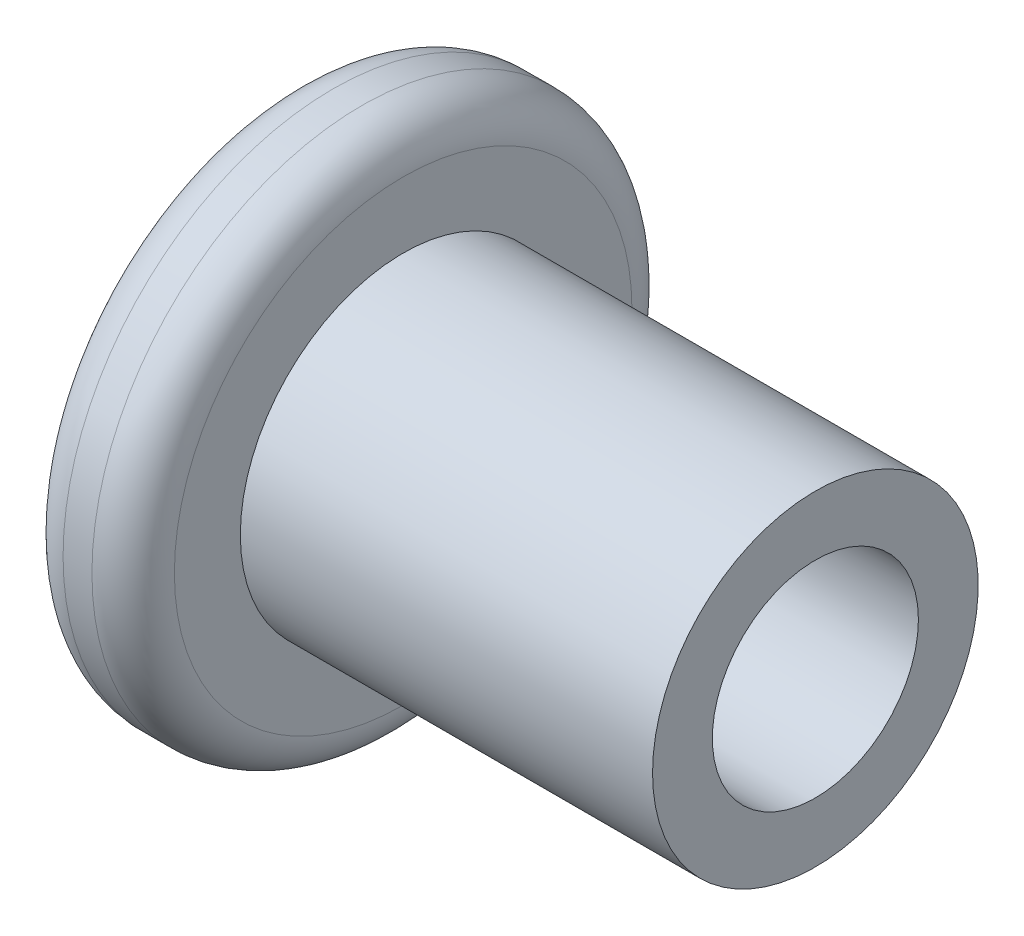
ISO-10303-21;
HEADER;
FILE_DESCRIPTION(('STEP AP214'),'2;1');
FILE_NAME('part.step','',(''),(''),'','','');
FILE_SCHEMA(('AUTOMOTIVE_DESIGN { 1 0 10303 214 1 1 1 1 }'));
ENDSEC;
DATA;
#1=APPLICATION_CONTEXT('core data for automotive mechanical design processes');
#2=APPLICATION_PROTOCOL_DEFINITION('international standard','automotive_design',2000,#1);
#3=PRODUCT_CONTEXT('',#1,'mechanical');
#4=PRODUCT('Part','Part','',(#3));
#5=PRODUCT_RELATED_PRODUCT_CATEGORY('part','',(#4));
#6=PRODUCT_DEFINITION_FORMATION('','',#4);
#7=PRODUCT_DEFINITION_CONTEXT('part definition',#1,'design');
#8=PRODUCT_DEFINITION('design','',#6,#7);
#9=PRODUCT_DEFINITION_SHAPE('','',#8);
#10=(LENGTH_UNIT() NAMED_UNIT(*) SI_UNIT(.MILLI.,.METRE.));
#11=(NAMED_UNIT(*) PLANE_ANGLE_UNIT() SI_UNIT($,.RADIAN.));
#12=(NAMED_UNIT(*) SI_UNIT($,.STERADIAN.) SOLID_ANGLE_UNIT());
#13=UNCERTAINTY_MEASURE_WITH_UNIT(LENGTH_MEASURE(1.E-05),#10,'distance_accuracy_value','');
#14=(GEOMETRIC_REPRESENTATION_CONTEXT(3) GLOBAL_UNCERTAINTY_ASSIGNED_CONTEXT((#13)) GLOBAL_UNIT_ASSIGNED_CONTEXT((#10,
#11,#12)) REPRESENTATION_CONTEXT('',''));
#15=CARTESIAN_POINT('',(0.,0.,0.));
#16=DIRECTION('',(0.,0.,1.));
#17=DIRECTION('',(1.,0.,0.));
#18=AXIS2_PLACEMENT_3D('',#15,#16,#17);
#19=CARTESIAN_POINT('',(0.,0.,0.));
#20=DIRECTION('',(1.,0.,0.));
#21=DIRECTION('',(0.,0.,-1.));
#22=AXIS2_PLACEMENT_3D('',#19,#20,#21);
#23=PLANE('',#22);
#24=DIRECTION('',(0.,0.,-1.));
#25=VECTOR('',#24,1.);
#26=CARTESIAN_POINT('',(0.,2.,1.15470053837925));
#27=LINE('',#26,#25);
#28=CARTESIAN_POINT('',(0.,2.,1.15470053837925));
#29=VERTEX_POINT('',#28);
#30=CARTESIAN_POINT('',(0.,2.,-1.15470053837925));
#31=VERTEX_POINT('',#30);
#32=EDGE_CURVE('E130',#29,#31,#27,.T.);
#33=ORIENTED_EDGE('',*,*,#32,.F.);
#34=DIRECTION('',(0.,0.866025403784438,-0.5));
#35=VECTOR('',#34,1.);
#36=CARTESIAN_POINT('',(0.,0.,2.3094010767585));
#37=LINE('',#36,#35);
#38=CARTESIAN_POINT('',(0.,0.,2.3094010767585));
#39=VERTEX_POINT('',#38);
#40=EDGE_CURVE('E54',#39,#29,#37,.T.);
#41=ORIENTED_EDGE('',*,*,#40,.F.);
#42=DIRECTION('',(0.,0.866025403784439,0.5));
#43=VECTOR('',#42,1.);
#44=CARTESIAN_POINT('',(0.,-2.,1.15470053837925));
#45=LINE('',#44,#43);
#46=CARTESIAN_POINT('',(0.,-2.,1.15470053837925));
#47=VERTEX_POINT('',#46);
#48=EDGE_CURVE('E140',#47,#39,#45,.T.);
#49=ORIENTED_EDGE('',*,*,#48,.F.);
#50=DIRECTION('',(0.,0.,1.));
#51=VECTOR('',#50,1.);
#52=CARTESIAN_POINT('',(0.,-2.,-1.15470053837925));
#53=LINE('',#52,#51);
#54=CARTESIAN_POINT('',(0.,-2.,-1.15470053837925));
#55=VERTEX_POINT('',#54);
#56=EDGE_CURVE('E138',#55,#47,#53,.T.);
#57=ORIENTED_EDGE('',*,*,#56,.F.);
#58=DIRECTION('',(0.,-0.866025403784439,0.5));
#59=VECTOR('',#58,1.);
#60=CARTESIAN_POINT('',(0.,0.,-2.3094010767585));
#61=LINE('',#60,#59);
#62=CARTESIAN_POINT('',(0.,0.,-2.3094010767585));
#63=VERTEX_POINT('',#62);
#64=EDGE_CURVE('E104',#63,#55,#61,.T.);
#65=ORIENTED_EDGE('',*,*,#64,.F.);
#66=DIRECTION('',(0.,-0.866025403784439,-0.5));
#67=VECTOR('',#66,1.);
#68=CARTESIAN_POINT('',(0.,2.,-1.15470053837925));
#69=LINE('',#68,#67);
#70=EDGE_CURVE('E134',#31,#63,#69,.T.);
#71=ORIENTED_EDGE('',*,*,#70,.F.);
#72=EDGE_LOOP('',(#33,#41,#49,#57,#65,#71));
#73=FACE_BOUND('',#72,.T.);
#74=CARTESIAN_POINT('',(0.,0.,0.));
#75=DIRECTION('',(1.,0.,0.));
#76=DIRECTION('',(0.,0.,-1.));
#77=AXIS2_PLACEMENT_3D('',#74,#75,#76);
#78=CIRCLE('',#77,5.55);
#79=CARTESIAN_POINT('',(0.,0.,-5.55));
#80=VERTEX_POINT('',#79);
#81=EDGE_CURVE('E11',#80,#80,#78,.F.);
#82=ORIENTED_EDGE('',*,*,#81,.T.);
#83=EDGE_LOOP('',(#82));
#84=FACE_BOUND('',#83,.T.);
#85=ADVANCED_FACE('F39',(#73,#84),#23,.F.);
#86=CARTESIAN_POINT('',(0.,0.,0.));
#87=DIRECTION('',(-1.,0.,0.));
#88=DIRECTION('',(0.,0.,1.));
#89=AXIS2_PLACEMENT_3D('',#86,#87,#88);
#90=CYLINDRICAL_SURFACE('',#89,6.55);
#91=CARTESIAN_POINT('',(1.7,0.,0.));
#92=DIRECTION('',(-1.,0.,0.));
#93=DIRECTION('',(0.,0.,1.));
#94=AXIS2_PLACEMENT_3D('',#91,#92,#93);
#95=CIRCLE('',#94,6.55);
#96=CARTESIAN_POINT('',(1.7,0.,6.55));
#97=VERTEX_POINT('',#96);
#98=EDGE_CURVE('E158',#97,#97,#95,.T.);
#99=ORIENTED_EDGE('',*,*,#98,.T.);
#100=EDGE_LOOP('',(#99));
#101=FACE_BOUND('',#100,.T.);
#102=CARTESIAN_POINT('',(1.,0.,0.));
#103=DIRECTION('',(1.,0.,0.));
#104=DIRECTION('',(0.,0.,-1.));
#105=AXIS2_PLACEMENT_3D('',#102,#103,#104);
#106=CIRCLE('',#105,6.55);
#107=CARTESIAN_POINT('',(1.,0.,-6.55));
#108=VERTEX_POINT('',#107);
#109=EDGE_CURVE('E155',#108,#108,#106,.T.);
#110=ORIENTED_EDGE('',*,*,#109,.T.);
#111=EDGE_LOOP('',(#110));
#112=FACE_BOUND('',#111,.T.);
#113=ADVANCED_FACE('F172',(#101,#112),#90,.T.);
#114=CARTESIAN_POINT('',(2.7,6.55,0.));
#115=DIRECTION('',(-1.,0.,0.));
#116=DIRECTION('',(0.,0.,1.));
#117=AXIS2_PLACEMENT_3D('',#114,#115,#116);
#118=PLANE('',#117);
#119=CARTESIAN_POINT('',(2.7,0.,0.));
#120=DIRECTION('',(-1.,0.,0.));
#121=DIRECTION('',(0.,0.,1.));
#122=AXIS2_PLACEMENT_3D('',#119,#120,#121);
#123=CIRCLE('',#122,5.55);
#124=CARTESIAN_POINT('',(2.7,0.,5.55));
#125=VERTEX_POINT('',#124);
#126=EDGE_CURVE('E47',#125,#125,#123,.F.);
#127=ORIENTED_EDGE('',*,*,#126,.T.);
#128=EDGE_LOOP('',(#127));
#129=FACE_BOUND('',#128,.T.);
#130=CARTESIAN_POINT('',(2.7,0.,0.));
#131=DIRECTION('',(-1.,0.,0.));
#132=DIRECTION('',(0.,0.,1.));
#133=AXIS2_PLACEMENT_3D('',#130,#131,#132);
#134=CIRCLE('',#133,3.95);
#135=CARTESIAN_POINT('',(2.7,0.,3.95));
#136=VERTEX_POINT('',#135);
#137=EDGE_CURVE('E152',#136,#136,#134,.T.);
#138=ORIENTED_EDGE('',*,*,#137,.T.);
#139=EDGE_LOOP('',(#138));
#140=FACE_BOUND('',#139,.T.);
#141=ADVANCED_FACE('F163',(#129,#140),#118,.F.);
#142=CARTESIAN_POINT('',(0.,0.,0.));
#143=DIRECTION('',(-1.,0.,0.));
#144=DIRECTION('',(0.,0.,1.));
#145=AXIS2_PLACEMENT_3D('',#142,#143,#144);
#146=CYLINDRICAL_SURFACE('',#145,3.95);
#147=ORIENTED_EDGE('',*,*,#137,.F.);
#148=EDGE_LOOP('',(#147));
#149=FACE_BOUND('',#148,.T.);
#150=CARTESIAN_POINT('',(12.7,0.,0.));
#151=DIRECTION('',(-1.,0.,0.));
#152=DIRECTION('',(0.,0.,1.));
#153=AXIS2_PLACEMENT_3D('',#150,#151,#152);
#154=CIRCLE('',#153,3.95);
#155=CARTESIAN_POINT('',(12.7,0.,3.95));
#156=VERTEX_POINT('',#155);
#157=EDGE_CURVE('E144',#156,#156,#154,.T.);
#158=ORIENTED_EDGE('',*,*,#157,.T.);
#159=EDGE_LOOP('',(#158));
#160=FACE_BOUND('',#159,.T.);
#161=ADVANCED_FACE('F192',(#149,#160),#146,.T.);
#162=CARTESIAN_POINT('',(12.7,3.95,0.));
#163=DIRECTION('',(-1.,0.,0.));
#164=DIRECTION('',(0.,0.,1.));
#165=AXIS2_PLACEMENT_3D('',#162,#163,#164);
#166=PLANE('',#165);
#167=CARTESIAN_POINT('',(12.7,0.,0.));
#168=DIRECTION('',(1.,0.,0.));
#169=DIRECTION('',(0.,0.,-1.));
#170=AXIS2_PLACEMENT_3D('',#167,#168,#169);
#171=CIRCLE('',#170,2.5);
#172=CARTESIAN_POINT('',(12.7,0.,-2.5));
#173=VERTEX_POINT('',#172);
#174=EDGE_CURVE('E232',#173,#173,#171,.T.);
#175=ORIENTED_EDGE('',*,*,#174,.F.);
#176=EDGE_LOOP('',(#175));
#177=FACE_BOUND('',#176,.T.);
#178=ORIENTED_EDGE('',*,*,#157,.F.);
#179=EDGE_LOOP('',(#178));
#180=FACE_BOUND('',#179,.T.);
#181=ADVANCED_FACE('F169',(#177,#180),#166,.F.);
#182=CARTESIAN_POINT('',(1.7,0.,0.));
#183=DIRECTION('',(-1.,0.,0.));
#184=DIRECTION('',(0.,0.,1.));
#185=AXIS2_PLACEMENT_3D('',#182,#183,#184);
#186=TOROIDAL_SURFACE('',#185,5.55,1.);
#187=ORIENTED_EDGE('',*,*,#126,.F.);
#188=EDGE_LOOP('',(#187));
#189=FACE_BOUND('',#188,.T.);
#190=ORIENTED_EDGE('',*,*,#98,.F.);
#191=EDGE_LOOP('',(#190));
#192=FACE_BOUND('',#191,.T.);
#193=ADVANCED_FACE('F166',(#189,#192),#186,.T.);
#194=CARTESIAN_POINT('',(1.,0.,0.));
#195=DIRECTION('',(1.,0.,0.));
#196=DIRECTION('',(0.,0.,-1.));
#197=AXIS2_PLACEMENT_3D('',#194,#195,#196);
#198=TOROIDAL_SURFACE('',#197,5.55,1.);
#199=ORIENTED_EDGE('',*,*,#109,.F.);
#200=EDGE_LOOP('',(#199));
#201=FACE_BOUND('',#200,.T.);
#202=ORIENTED_EDGE('',*,*,#81,.F.);
#203=EDGE_LOOP('',(#202));
#204=FACE_BOUND('',#203,.T.);
#205=ADVANCED_FACE('F41',(#201,#204),#198,.T.);
#206=CARTESIAN_POINT('',(1.,0.,2.3094010767585));
#207=DIRECTION('',(0.,0.5,0.866025403784439));
#208=DIRECTION('',(0.,-0.866025403784439,0.5));
#209=AXIS2_PLACEMENT_3D('',#206,#207,#208);
#210=PLANE('',#209);
#211=ORIENTED_EDGE('',*,*,#40,.T.);
#212=DIRECTION('',(-1.,0.,0.));
#213=VECTOR('',#212,1.);
#214=CARTESIAN_POINT('',(1.,2.,1.15470053837925));
#215=LINE('',#214,#213);
#216=CARTESIAN_POINT('',(1.,2.,1.15470053837925));
#217=VERTEX_POINT('',#216);
#218=EDGE_CURVE('E85',#217,#29,#215,.T.);
#219=ORIENTED_EDGE('',*,*,#218,.F.);
#220=DIRECTION('',(0.,0.866025403784438,-0.5));
#221=VECTOR('',#220,1.);
#222=CARTESIAN_POINT('',(1.,0.,2.3094010767585));
#223=LINE('',#222,#221);
#224=CARTESIAN_POINT('',(1.,0.,2.3094010767585));
#225=VERTEX_POINT('',#224);
#226=EDGE_CURVE('E142',#225,#217,#223,.T.);
#227=ORIENTED_EDGE('',*,*,#226,.F.);
#228=DIRECTION('',(-1.,0.,0.));
#229=VECTOR('',#228,1.);
#230=CARTESIAN_POINT('',(1.,0.,2.3094010767585));
#231=LINE('',#230,#229);
#232=EDGE_CURVE('E62',#225,#39,#231,.T.);
#233=ORIENTED_EDGE('',*,*,#232,.T.);
#234=EDGE_LOOP('',(#211,#219,#227,#233));
#235=FACE_BOUND('',#234,.T.);
#236=ADVANCED_FACE('F180',(#235),#210,.F.);
#237=CARTESIAN_POINT('',(1.,-2.,1.15470053837925));
#238=DIRECTION('',(0.,-0.5,0.866025403784439));
#239=DIRECTION('',(0.,-0.866025403784439,-0.5));
#240=AXIS2_PLACEMENT_3D('',#237,#238,#239);
#241=PLANE('',#240);
#242=ORIENTED_EDGE('',*,*,#48,.T.);
#243=ORIENTED_EDGE('',*,*,#232,.F.);
#244=DIRECTION('',(0.,0.866025403784439,0.5));
#245=VECTOR('',#244,1.);
#246=CARTESIAN_POINT('',(1.,-2.,1.15470053837925));
#247=LINE('',#246,#245);
#248=CARTESIAN_POINT('',(1.,-2.,1.15470053837925));
#249=VERTEX_POINT('',#248);
#250=EDGE_CURVE('E116',#249,#225,#247,.T.);
#251=ORIENTED_EDGE('',*,*,#250,.F.);
#252=DIRECTION('',(-1.,0.,0.));
#253=VECTOR('',#252,1.);
#254=CARTESIAN_POINT('',(1.,-2.,1.15470053837925));
#255=LINE('',#254,#253);
#256=EDGE_CURVE('E108',#249,#47,#255,.T.);
#257=ORIENTED_EDGE('',*,*,#256,.T.);
#258=EDGE_LOOP('',(#242,#243,#251,#257));
#259=FACE_BOUND('',#258,.T.);
#260=ADVANCED_FACE('F201',(#259),#241,.F.);
#261=CARTESIAN_POINT('',(1.,-2.,-1.15470053837925));
#262=DIRECTION('',(0.,-1.,0.));
#263=DIRECTION('',(0.,0.,-1.));
#264=AXIS2_PLACEMENT_3D('',#261,#262,#263);
#265=PLANE('',#264);
#266=ORIENTED_EDGE('',*,*,#56,.T.);
#267=ORIENTED_EDGE('',*,*,#256,.F.);
#268=DIRECTION('',(0.,0.,1.));
#269=VECTOR('',#268,1.);
#270=CARTESIAN_POINT('',(1.,-2.,-1.15470053837925));
#271=LINE('',#270,#269);
#272=CARTESIAN_POINT('',(1.,-2.,-1.15470053837925));
#273=VERTEX_POINT('',#272);
#274=EDGE_CURVE('E112',#273,#249,#271,.T.);
#275=ORIENTED_EDGE('',*,*,#274,.F.);
#276=DIRECTION('',(-1.,0.,0.));
#277=VECTOR('',#276,1.);
#278=CARTESIAN_POINT('',(1.,-2.,-1.15470053837925));
#279=LINE('',#278,#277);
#280=EDGE_CURVE('E97',#273,#55,#279,.T.);
#281=ORIENTED_EDGE('',*,*,#280,.T.);
#282=EDGE_LOOP('',(#266,#267,#275,#281));
#283=FACE_BOUND('',#282,.T.);
#284=ADVANCED_FACE('F113',(#283),#265,.F.);
#285=CARTESIAN_POINT('',(1.,0.,-2.3094010767585));
#286=DIRECTION('',(0.,-0.5,-0.866025403784439));
#287=DIRECTION('',(0.,0.866025403784439,-0.5));
#288=AXIS2_PLACEMENT_3D('',#285,#286,#287);
#289=PLANE('',#288);
#290=ORIENTED_EDGE('',*,*,#64,.T.);
#291=ORIENTED_EDGE('',*,*,#280,.F.);
#292=DIRECTION('',(0.,-0.866025403784439,0.5));
#293=VECTOR('',#292,1.);
#294=CARTESIAN_POINT('',(1.,0.,-2.3094010767585));
#295=LINE('',#294,#293);
#296=CARTESIAN_POINT('',(1.,0.,-2.3094010767585));
#297=VERTEX_POINT('',#296);
#298=EDGE_CURVE('E101',#297,#273,#295,.T.);
#299=ORIENTED_EDGE('',*,*,#298,.F.);
#300=DIRECTION('',(-1.,0.,0.));
#301=VECTOR('',#300,1.);
#302=CARTESIAN_POINT('',(1.,0.,-2.3094010767585));
#303=LINE('',#302,#301);
#304=EDGE_CURVE('E109',#297,#63,#303,.T.);
#305=ORIENTED_EDGE('',*,*,#304,.T.);
#306=EDGE_LOOP('',(#290,#291,#299,#305));
#307=FACE_BOUND('',#306,.T.);
#308=ADVANCED_FACE('F99',(#307),#289,.F.);
#309=CARTESIAN_POINT('',(1.,2.,-1.15470053837925));
#310=DIRECTION('',(0.,0.5,-0.866025403784439));
#311=DIRECTION('',(0.,0.866025403784439,0.5));
#312=AXIS2_PLACEMENT_3D('',#309,#310,#311);
#313=PLANE('',#312);
#314=ORIENTED_EDGE('',*,*,#70,.T.);
#315=ORIENTED_EDGE('',*,*,#304,.F.);
#316=DIRECTION('',(0.,-0.866025403784439,-0.5));
#317=VECTOR('',#316,1.);
#318=CARTESIAN_POINT('',(1.,2.,-1.15470053837925));
#319=LINE('',#318,#317);
#320=CARTESIAN_POINT('',(1.,2.,-1.15470053837925));
#321=VERTEX_POINT('',#320);
#322=EDGE_CURVE('E122',#321,#297,#319,.T.);
#323=ORIENTED_EDGE('',*,*,#322,.F.);
#324=DIRECTION('',(-1.,0.,0.));
#325=VECTOR('',#324,1.);
#326=CARTESIAN_POINT('',(1.,2.,-1.15470053837925));
#327=LINE('',#326,#325);
#328=EDGE_CURVE('E147',#321,#31,#327,.T.);
#329=ORIENTED_EDGE('',*,*,#328,.T.);
#330=EDGE_LOOP('',(#314,#315,#323,#329));
#331=FACE_BOUND('',#330,.T.);
#332=ADVANCED_FACE('F205',(#331),#313,.F.);
#333=CARTESIAN_POINT('',(1.,2.,1.15470053837925));
#334=DIRECTION('',(0.,1.,0.));
#335=DIRECTION('',(0.,0.,1.));
#336=AXIS2_PLACEMENT_3D('',#333,#334,#335);
#337=PLANE('',#336);
#338=ORIENTED_EDGE('',*,*,#32,.T.);
#339=ORIENTED_EDGE('',*,*,#328,.F.);
#340=DIRECTION('',(0.,0.,-1.));
#341=VECTOR('',#340,1.);
#342=CARTESIAN_POINT('',(1.,2.,1.15470053837925));
#343=LINE('',#342,#341);
#344=EDGE_CURVE('E124',#217,#321,#343,.T.);
#345=ORIENTED_EDGE('',*,*,#344,.F.);
#346=ORIENTED_EDGE('',*,*,#218,.T.);
#347=EDGE_LOOP('',(#338,#339,#345,#346));
#348=FACE_BOUND('',#347,.T.);
#349=ADVANCED_FACE('F202',(#348),#337,.F.);
#350=CARTESIAN_POINT('',(1.,0.,0.));
#351=DIRECTION('',(-1.,0.,0.));
#352=DIRECTION('',(0.,0.,1.));
#353=AXIS2_PLACEMENT_3D('',#350,#351,#352);
#354=PLANE('',#353);
#355=ORIENTED_EDGE('',*,*,#226,.T.);
#356=ORIENTED_EDGE('',*,*,#344,.T.);
#357=ORIENTED_EDGE('',*,*,#322,.T.);
#358=ORIENTED_EDGE('',*,*,#298,.T.);
#359=ORIENTED_EDGE('',*,*,#274,.T.);
#360=ORIENTED_EDGE('',*,*,#250,.T.);
#361=EDGE_LOOP('',(#355,#356,#357,#358,#359,#360));
#362=FACE_BOUND('',#361,.T.);
#363=ADVANCED_FACE('F119',(#362),#354,.T.);
#364=CARTESIAN_POINT('',(8.6,0.,0.));
#365=DIRECTION('',(1.,0.,0.));
#366=DIRECTION('',(0.,0.,-1.));
#367=AXIS2_PLACEMENT_3D('',#364,#365,#366);
#368=CONICAL_SURFACE('',#367,2.5,1.02974425867665);
#369=CARTESIAN_POINT('',(7.0978484524311,0.,0.));
#370=VERTEX_POINT('',#369);
#371=VERTEX_LOOP('',#370);
#372=FACE_BOUND('',#371,.T.);
#373=CARTESIAN_POINT('',(8.6,0.,0.));
#374=DIRECTION('',(1.,0.,0.));
#375=DIRECTION('',(0.,0.,-1.));
#376=AXIS2_PLACEMENT_3D('',#373,#374,#375);
#377=CIRCLE('',#376,2.5);
#378=CARTESIAN_POINT('',(8.6,0.,-2.5));
#379=VERTEX_POINT('',#378);
#380=EDGE_CURVE('E131',#379,#379,#377,.T.);
#381=ORIENTED_EDGE('',*,*,#380,.T.);
#382=EDGE_LOOP('',(#381));
#383=FACE_BOUND('',#382,.T.);
#384=ADVANCED_FACE('F218',(#372,#383),#368,.F.);
#385=CARTESIAN_POINT('',(12.7,0.,0.));
#386=DIRECTION('',(1.,0.,0.));
#387=DIRECTION('',(0.,0.,-1.));
#388=AXIS2_PLACEMENT_3D('',#385,#386,#387);
#389=CYLINDRICAL_SURFACE('',#388,2.5);
#390=ORIENTED_EDGE('',*,*,#380,.F.);
#391=EDGE_LOOP('',(#390));
#392=FACE_BOUND('',#391,.T.);
#393=ORIENTED_EDGE('',*,*,#174,.T.);
#394=EDGE_LOOP('',(#393));
#395=FACE_BOUND('',#394,.T.);
#396=ADVANCED_FACE('F221',(#392,#395),#389,.F.);
#397=CLOSED_SHELL('',(#85,#113,#141,#161,#181,#193,#205,#236,#260,#284,#308,#332,#349,#363,#384,#396));
#398=MANIFOLD_SOLID_BREP('B2',#397);
#399=ADVANCED_BREP_SHAPE_REPRESENTATION('',(#18,#398),#14);
#400=SHAPE_DEFINITION_REPRESENTATION(#9,#399);
ENDSEC;
END-ISO-10303-21;
